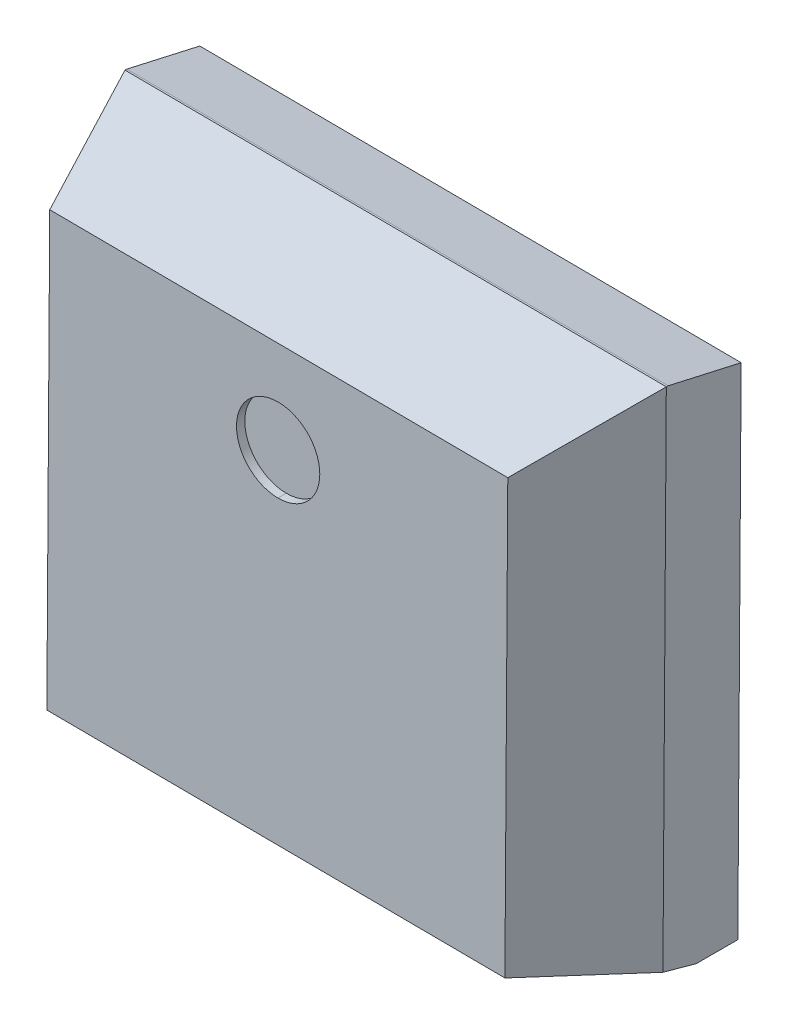
ISO-10303-21;
HEADER;
FILE_DESCRIPTION(('STEP AP214'),'2;1');
FILE_NAME('part.step','',(''),(''),'','','');
FILE_SCHEMA(('AUTOMOTIVE_DESIGN { 1 0 10303 214 1 1 1 1 }'));
ENDSEC;
DATA;
#1=APPLICATION_CONTEXT('core data for automotive mechanical design processes');
#2=APPLICATION_PROTOCOL_DEFINITION('international standard','automotive_design',2000,#1);
#3=PRODUCT_CONTEXT('',#1,'mechanical');
#4=PRODUCT('Part','Part','',(#3));
#5=PRODUCT_RELATED_PRODUCT_CATEGORY('part','',(#4));
#6=PRODUCT_DEFINITION_FORMATION('','',#4);
#7=PRODUCT_DEFINITION_CONTEXT('part definition',#1,'design');
#8=PRODUCT_DEFINITION('design','',#6,#7);
#9=PRODUCT_DEFINITION_SHAPE('','',#8);
#10=(LENGTH_UNIT() NAMED_UNIT(*) SI_UNIT(.MILLI.,.METRE.));
#11=(NAMED_UNIT(*) PLANE_ANGLE_UNIT() SI_UNIT($,.RADIAN.));
#12=(NAMED_UNIT(*) SI_UNIT($,.STERADIAN.) SOLID_ANGLE_UNIT());
#13=UNCERTAINTY_MEASURE_WITH_UNIT(LENGTH_MEASURE(1.E-05),#10,'distance_accuracy_value','');
#14=(GEOMETRIC_REPRESENTATION_CONTEXT(3) GLOBAL_UNCERTAINTY_ASSIGNED_CONTEXT((#13)) GLOBAL_UNIT_ASSIGNED_CONTEXT((#10,
#11,#12)) REPRESENTATION_CONTEXT('',''));
#15=CARTESIAN_POINT('',(0.,0.,0.));
#16=DIRECTION('',(0.,0.,1.));
#17=DIRECTION('',(1.,0.,0.));
#18=AXIS2_PLACEMENT_3D('',#15,#16,#17);
#19=CARTESIAN_POINT('',(202.089449758014,99.0514799525526,144.531582908599));
#20=DIRECTION('',(0.,0.,-1.));
#21=DIRECTION('',(0.00663069374923224,0.99997801670857,0.));
#22=AXIS2_PLACEMENT_3D('',#19,#20,#21);
#23=CYLINDRICAL_SURFACE('',#22,0.5);
#24=CARTESIAN_POINT('',(202.089449758014,99.0514799525526,144.531582908599));
#25=DIRECTION('',(0.,0.,-1.));
#26=DIRECTION('',(0.00663069374923224,0.99997801670857,0.));
#27=AXIS2_PLACEMENT_3D('',#24,#25,#26);
#28=CIRCLE('',#27,0.5);
#29=CARTESIAN_POINT('',(202.086134411139,98.5514909441983,144.531582908599));
#30=VERTEX_POINT('',#29);
#31=CARTESIAN_POINT('',(202.092765104888,99.5514689609069,144.531582908599));
#32=VERTEX_POINT('',#31);
#33=EDGE_CURVE('E67',#30,#32,#28,.T.);
#34=ORIENTED_EDGE('',*,*,#33,.F.);
#35=DIRECTION('',(0.,0.,-1.));
#36=VECTOR('',#35,1.);
#37=CARTESIAN_POINT('',(202.086134411139,98.5514909441983,144.531582908599));
#38=LINE('',#37,#36);
#39=CARTESIAN_POINT('',(202.086134411139,98.5514909441983,144.431582908599));
#40=VERTEX_POINT('',#39);
#41=EDGE_CURVE('E11',#30,#40,#38,.T.);
#42=ORIENTED_EDGE('',*,*,#41,.T.);
#43=CARTESIAN_POINT('',(202.089449758014,99.0514799525526,144.431582908599));
#44=DIRECTION('',(0.,0.,-1.));
#45=DIRECTION('',(0.00663069374923224,0.99997801670857,0.));
#46=AXIS2_PLACEMENT_3D('',#43,#44,#45);
#47=CIRCLE('',#46,0.5);
#48=CARTESIAN_POINT('',(202.092765104888,99.5514689609069,144.431582908599));
#49=VERTEX_POINT('',#48);
#50=EDGE_CURVE('E55',#40,#49,#47,.T.);
#51=ORIENTED_EDGE('',*,*,#50,.T.);
#52=DIRECTION('',(0.,0.,-1.));
#53=VECTOR('',#52,1.);
#54=CARTESIAN_POINT('',(202.092765104888,99.5514689609069,144.531582908599));
#55=LINE('',#54,#53);
#56=EDGE_CURVE('E128',#32,#49,#55,.T.);
#57=ORIENTED_EDGE('',*,*,#56,.F.);
#58=EDGE_LOOP('',(#34,#42,#51,#57));
#59=FACE_BOUND('',#58,.T.);
#60=ADVANCED_FACE('F44',(#59),#23,.F.);
#61=CARTESIAN_POINT('',(202.089449758014,99.0514799525526,144.431582908599));
#62=DIRECTION('',(0.,0.,-1.));
#63=DIRECTION('',(-1.,0.,0.));
#64=AXIS2_PLACEMENT_3D('',#61,#62,#63);
#65=PLANE('',#64);
#66=CARTESIAN_POINT('',(202.089449758014,99.0514799525526,144.431582908599));
#67=DIRECTION('',(0.,0.,-1.));
#68=DIRECTION('',(0.00663069374923224,0.99997801670857,0.));
#69=AXIS2_PLACEMENT_3D('',#66,#67,#68);
#70=CIRCLE('',#69,0.5);
#71=EDGE_CURVE('E132',#49,#40,#70,.T.);
#72=ORIENTED_EDGE('',*,*,#71,.F.);
#73=ORIENTED_EDGE('',*,*,#50,.F.);
#74=EDGE_LOOP('',(#72,#73));
#75=FACE_BOUND('',#74,.T.);
#76=ADVANCED_FACE('F140',(#75),#65,.F.);
#77=CARTESIAN_POINT('',(202.089449758014,99.0514799525526,144.531582908599));
#78=DIRECTION('',(0.,0.,-1.));
#79=DIRECTION('',(0.00663069374923224,0.99997801670857,0.));
#80=AXIS2_PLACEMENT_3D('',#77,#78,#79);
#81=CYLINDRICAL_SURFACE('',#80,0.5);
#82=ORIENTED_EDGE('',*,*,#41,.F.);
#83=CARTESIAN_POINT('',(202.089449758014,99.0514799525526,144.531582908599));
#84=DIRECTION('',(0.,0.,-1.));
#85=DIRECTION('',(0.00663069374923224,0.99997801670857,0.));
#86=AXIS2_PLACEMENT_3D('',#83,#84,#85);
#87=CIRCLE('',#86,0.5);
#88=EDGE_CURVE('E134',#32,#30,#87,.T.);
#89=ORIENTED_EDGE('',*,*,#88,.F.);
#90=ORIENTED_EDGE('',*,*,#56,.T.);
#91=ORIENTED_EDGE('',*,*,#71,.T.);
#92=EDGE_LOOP('',(#82,#89,#90,#91));
#93=FACE_BOUND('',#92,.T.);
#94=ADVANCED_FACE('F130',(#93),#81,.F.);
#95=CARTESIAN_POINT('',(199.09687577795,100.181347632347,143.831582908599));
#96=DIRECTION('',(0.94172120900801,-0.00624440220660673,-0.336336396997966));
#97=DIRECTION('',(0.,-0.999827697432078,0.0185627435383068));
#98=AXIS2_PLACEMENT_3D('',#95,#96,#97);
#99=PLANE('',#98);
#100=DIRECTION('',(-0.00663069374923689,-0.999978016708569,0.));
#101=VECTOR('',#100,1.);
#102=CARTESIAN_POINT('',(198.846881273772,100.183005305784,143.131582908599));
#103=LINE('',#102,#101);
#104=CARTESIAN_POINT('',(198.850196620647,100.682994314138,143.131582908599));
#105=VERTEX_POINT('',#104);
#106=CARTESIAN_POINT('',(198.809690449277,94.5742397187342,143.131582908599));
#107=VERTEX_POINT('',#106);
#108=EDGE_CURVE('E142',#105,#107,#103,.T.);
#109=ORIENTED_EDGE('',*,*,#108,.T.);
#110=DIRECTION('',(-0.327058115701999,-0.250915811518072,-0.911084103957305));
#111=VECTOR('',#110,1.);
#112=CARTESIAN_POINT('',(199.239655618504,94.9041048227679,144.329334660141));
#113=LINE('',#112,#111);
#114=CARTESIAN_POINT('',(199.312258060756,94.9598047116908,144.531582908599));
#115=VERTEX_POINT('',#114);
#116=EDGE_CURVE('E181',#115,#107,#113,.T.);
#117=ORIENTED_EDGE('',*,*,#116,.F.);
#118=DIRECTION('',(-0.00663069374923689,-0.999978016708569,0.));
#119=VECTOR('',#118,1.);
#120=CARTESIAN_POINT('',(199.346870282127,100.179689958909,144.531582908599));
#121=LINE('',#120,#119);
#122=CARTESIAN_POINT('',(199.346870282127,100.179689958909,144.531582908599));
#123=VERTEX_POINT('',#122);
#124=EDGE_CURVE('E159',#123,#115,#121,.T.);
#125=ORIENTED_EDGE('',*,*,#124,.F.);
#126=DIRECTION('',(-0.316667560551509,0.320895136477479,-0.892607398288552));
#127=VECTOR('',#126,1.);
#128=CARTESIAN_POINT('',(199.426620727771,100.098874828699,144.756379656566));
#129=LINE('',#128,#127);
#130=EDGE_CURVE('E148',#123,#105,#129,.T.);
#131=ORIENTED_EDGE('',*,*,#130,.T.);
#132=EDGE_LOOP('',(#109,#117,#125,#131));
#133=FACE_BOUND('',#132,.T.);
#134=ADVANCED_FACE('F259',(#133),#99,.F.);
#135=CARTESIAN_POINT('',(202.07950371739,97.5515129274897,144.531582908599));
#136=DIRECTION('',(0.,0.,1.));
#137=DIRECTION('',(1.,0.,0.));
#138=AXIS2_PLACEMENT_3D('',#135,#136,#137);
#139=PLANE('',#138);
#140=DIRECTION('',(-0.999978016708569,0.00663069374923689,0.));
#141=VECTOR('',#140,1.);
#142=CARTESIAN_POINT('',(205.346738382378,100.139905796414,144.531582908599));
#143=LINE('',#142,#141);
#144=CARTESIAN_POINT('',(204.846749374023,100.143221143289,144.531582908599));
#145=VERTEX_POINT('',#144);
#146=EDGE_CURVE('E163',#145,#123,#143,.T.);
#147=ORIENTED_EDGE('',*,*,#146,.T.);
#148=ORIENTED_EDGE('',*,*,#124,.T.);
#149=DIRECTION('',(0.999978016708569,-0.00663069374923689,0.));
#150=VECTOR('',#149,1.);
#151=CARTESIAN_POINT('',(198.812269052401,94.9631200585654,144.531582908599));
#152=LINE('',#151,#150);
#153=CARTESIAN_POINT('',(204.812137152652,94.92333589607,144.531582908599));
#154=VERTEX_POINT('',#153);
#155=EDGE_CURVE('E164',#115,#154,#152,.T.);
#156=ORIENTED_EDGE('',*,*,#155,.T.);
#157=DIRECTION('',(0.00663069374923689,0.999978016708569,0.));
#158=VECTOR('',#157,1.);
#159=CARTESIAN_POINT('',(204.812137152652,94.92333589607,144.531582908599));
#160=LINE('',#159,#158);
#161=EDGE_CURVE('E168',#154,#145,#160,.T.);
#162=ORIENTED_EDGE('',*,*,#161,.T.);
#163=EDGE_LOOP('',(#147,#148,#156,#162));
#164=FACE_BOUND('',#163,.T.);
#165=ORIENTED_EDGE('',*,*,#88,.T.);
#166=ORIENTED_EDGE('',*,*,#33,.T.);
#167=EDGE_LOOP('',(#165,#166));
#168=FACE_BOUND('',#167,.T.);
#169=ADVANCED_FACE('F297',(#164,#168),#139,.T.);
#170=CARTESIAN_POINT('',(198.808953705527,94.4631310502111,142.231582908599));
#171=DIRECTION('',(0.00663069374923689,0.99997801670857,0.));
#172=DIRECTION('',(0.,0.,-1.));
#173=AXIS2_PLACEMENT_3D('',#170,#171,#172);
#174=PLANE('',#173);
#175=DIRECTION('',(0.999978016708569,-0.00663069374923689,0.));
#176=VECTOR('',#175,1.);
#177=CARTESIAN_POINT('',(198.808953705527,94.4631310502111,142.231582908599));
#178=LINE('',#177,#176);
#179=CARTESIAN_POINT('',(198.808953705527,94.4631310502111,142.231582908599));
#180=VERTEX_POINT('',#179);
#181=CARTESIAN_POINT('',(205.308810814132,94.420031540841,142.231582908599));
#182=VERTEX_POINT('',#181);
#183=EDGE_CURVE('E173',#180,#182,#178,.T.);
#184=ORIENTED_EDGE('',*,*,#183,.T.);
#185=DIRECTION('',(0.,0.,1.));
#186=VECTOR('',#185,1.);
#187=CARTESIAN_POINT('',(205.308810814132,94.420031540841,142.231582908599));
#188=LINE('',#187,#186);
#189=CARTESIAN_POINT('',(205.308810814132,94.420031540841,142.731582908599));
#190=VERTEX_POINT('',#189);
#191=EDGE_CURVE('E177',#182,#190,#188,.T.);
#192=ORIENTED_EDGE('',*,*,#191,.T.);
#193=DIRECTION('',(0.999978016708569,-0.00663069374923689,0.));
#194=VECTOR('',#193,1.);
#195=CARTESIAN_POINT('',(198.808953705527,94.4631310502111,142.731582908599));
#196=LINE('',#195,#194);
#197=CARTESIAN_POINT('',(198.808953705527,94.4631310502111,142.731582908599));
#198=VERTEX_POINT('',#197);
#199=EDGE_CURVE('E223',#198,#190,#196,.T.);
#200=ORIENTED_EDGE('',*,*,#199,.F.);
#201=DIRECTION('',(0.,0.,1.));
#202=VECTOR('',#201,1.);
#203=CARTESIAN_POINT('',(198.808953705527,94.4631310502111,142.231582908599));
#204=LINE('',#203,#202);
#205=EDGE_CURVE('E187',#180,#198,#204,.T.);
#206=ORIENTED_EDGE('',*,*,#205,.F.);
#207=EDGE_LOOP('',(#184,#192,#200,#206));
#208=FACE_BOUND('',#207,.T.);
#209=ADVANCED_FACE('F293',(#208),#174,.F.);
#210=CARTESIAN_POINT('',(198.810611378964,94.7131255543882,143.631582908599));
#211=DIRECTION('',(0.00638879218066123,0.963496728334963,-0.267643863785991));
#212=DIRECTION('',(-0.999715221369126,0.,-0.0238636996896671));
#213=AXIS2_PLACEMENT_3D('',#210,#211,#212);
#214=PLANE('',#213);
#215=ORIENTED_EDGE('',*,*,#155,.F.);
#216=ORIENTED_EDGE('',*,*,#116,.T.);
#217=DIRECTION('',(0.00177466449462739,0.267637980092934,0.963517909629969));
#218=VECTOR('',#217,1.);
#219=CARTESIAN_POINT('',(198.810832243763,94.7464342777238,143.751496948714));
#220=LINE('',#219,#218);
#221=EDGE_CURVE('E191',#198,#107,#220,.T.);
#222=ORIENTED_EDGE('',*,*,#221,.F.);
#223=ORIENTED_EDGE('',*,*,#199,.T.);
#224=DIRECTION('',(0.00177466449462739,0.267637980092934,0.963517909629969));
#225=VECTOR('',#224,1.);
#226=CARTESIAN_POINT('',(205.309212170595,94.4805602961505,142.949491218055));
#227=LINE('',#226,#225);
#228=CARTESIAN_POINT('',(205.309547557882,94.5311402093641,143.131582908599));
#229=VERTEX_POINT('',#228);
#230=EDGE_CURVE('E48',#190,#229,#227,.T.);
#231=ORIENTED_EDGE('',*,*,#230,.T.);
#232=DIRECTION('',(0.323701938105808,-0.25523089699889,-0.911084103957305));
#233=VECTOR('',#232,1.);
#234=CARTESIAN_POINT('',(204.755493847069,94.9679977284263,144.691009866667));
#235=LINE('',#234,#233);
#236=EDGE_CURVE('E157',#154,#229,#235,.T.);
#237=ORIENTED_EDGE('',*,*,#236,.F.);
#238=EDGE_LOOP('',(#215,#216,#222,#223,#231,#237));
#239=FACE_BOUND('',#238,.T.);
#240=ADVANCED_FACE('F269',(#239),#214,.F.);
#241=CARTESIAN_POINT('',(202.07950371739,97.5515129274897,142.231582908599));
#242=DIRECTION('',(0.,0.,1.));
#243=DIRECTION('',(1.,0.,0.));
#244=AXIS2_PLACEMENT_3D('',#241,#242,#243);
#245=PLANE('',#244);
#246=DIRECTION('',(-0.999978016708569,0.00663069374923689,0.));
#247=VECTOR('',#246,1.);
#248=CARTESIAN_POINT('',(205.348727590503,100.439899201427,142.231582908599));
#249=LINE('',#248,#247);
#250=CARTESIAN_POINT('',(205.348727590503,100.439899201427,142.231582908599));
#251=VERTEX_POINT('',#250);
#252=CARTESIAN_POINT('',(198.848870481897,100.482998710797,142.231582908599));
#253=VERTEX_POINT('',#252);
#254=EDGE_CURVE('E197',#251,#253,#249,.T.);
#255=ORIENTED_EDGE('',*,*,#254,.F.);
#256=DIRECTION('',(0.00663069374923689,0.999978016708569,0.));
#257=VECTOR('',#256,1.);
#258=CARTESIAN_POINT('',(205.308810814132,94.420031540841,142.231582908599));
#259=LINE('',#258,#257);
#260=EDGE_CURVE('E182',#182,#251,#259,.T.);
#261=ORIENTED_EDGE('',*,*,#260,.F.);
#262=ORIENTED_EDGE('',*,*,#183,.F.);
#263=DIRECTION('',(-0.00663069374923689,-0.999978016708569,0.));
#264=VECTOR('',#263,1.);
#265=CARTESIAN_POINT('',(198.850196620647,100.682994314138,142.231582908599));
#266=LINE('',#265,#264);
#267=EDGE_CURVE('E151',#253,#180,#266,.T.);
#268=ORIENTED_EDGE('',*,*,#267,.F.);
#269=EDGE_LOOP('',(#255,#261,#262,#268));
#270=FACE_BOUND('',#269,.T.);
#271=ADVANCED_FACE('F318',(#270),#245,.F.);
#272=CARTESIAN_POINT('',(205.06213165683,94.9216782226327,143.831582908599));
#273=DIRECTION('',(-0.94172120900801,0.00624440220660673,-0.336336396997966));
#274=DIRECTION('',(-0.336342954498126,0.,0.94173956960482));
#275=AXIS2_PLACEMENT_3D('',#272,#273,#274);
#276=PLANE('',#275);
#277=DIRECTION('',(0.00663069374923689,0.999978016708569,0.));
#278=VECTOR('',#277,1.);
#279=CARTESIAN_POINT('',(205.312126161007,94.9200205491954,143.131582908599));
#280=LINE('',#279,#278);
#281=CARTESIAN_POINT('',(205.350053729252,100.639894804768,143.131582908599));
#282=VERTEX_POINT('',#281);
#283=EDGE_CURVE('E205',#229,#282,#280,.T.);
#284=ORIENTED_EDGE('',*,*,#283,.T.);
#285=DIRECTION('',(0.320895136477479,0.316667560551509,-0.892607398288552));
#286=VECTOR('',#285,1.);
#287=CARTESIAN_POINT('',(204.831404729047,100.128078653609,144.574265835428));
#288=LINE('',#287,#286);
#289=EDGE_CURVE('E196',#145,#282,#288,.T.);
#290=ORIENTED_EDGE('',*,*,#289,.F.);
#291=ORIENTED_EDGE('',*,*,#161,.F.);
#292=ORIENTED_EDGE('',*,*,#236,.T.);
#293=EDGE_LOOP('',(#284,#290,#291,#292));
#294=FACE_BOUND('',#293,.T.);
#295=ADVANCED_FACE('F239',(#294),#276,.F.);
#296=CARTESIAN_POINT('',(198.850196620647,100.682994314138,142.231582908599));
#297=DIRECTION('',(0.99997801670857,-0.00663069374923689,0.));
#298=DIRECTION('',(0.,0.,-1.));
#299=AXIS2_PLACEMENT_3D('',#296,#297,#298);
#300=PLANE('',#299);
#301=DIRECTION('',(-0.00146950166626721,-0.221616231627791,-0.97513285579143));
#302=VECTOR('',#301,1.);
#303=CARTESIAN_POINT('',(198.849234583842,100.537909095015,142.473193910564));
#304=LINE('',#303,#302);
#305=CARTESIAN_POINT('',(198.850196620647,100.682994314138,143.111582908599));
#306=VERTEX_POINT('',#305);
#307=EDGE_CURVE('E154',#306,#253,#304,.T.);
#308=ORIENTED_EDGE('',*,*,#307,.T.);
#309=ORIENTED_EDGE('',*,*,#267,.T.);
#310=ORIENTED_EDGE('',*,*,#205,.T.);
#311=ORIENTED_EDGE('',*,*,#221,.T.);
#312=ORIENTED_EDGE('',*,*,#108,.F.);
#313=DIRECTION('',(0.,0.,1.));
#314=VECTOR('',#313,1.);
#315=CARTESIAN_POINT('',(198.850196620647,100.682994314138,142.231582908599));
#316=LINE('',#315,#314);
#317=EDGE_CURVE('E211',#306,#105,#316,.T.);
#318=ORIENTED_EDGE('',*,*,#317,.F.);
#319=EDGE_LOOP('',(#308,#309,#310,#311,#312,#318));
#320=FACE_BOUND('',#319,.T.);
#321=ADVANCED_FACE('F46',(#320),#300,.F.);
#322=CARTESIAN_POINT('',(205.348396055815,100.389900300591,143.831582908599));
#323=DIRECTION('',(-0.00624440220660673,-0.94172120900801,-0.336336396997966));
#324=DIRECTION('',(0.,0.336342954498126,-0.94173956960482));
#325=AXIS2_PLACEMENT_3D('',#322,#323,#324);
#326=PLANE('',#325);
#327=ORIENTED_EDGE('',*,*,#289,.T.);
#328=DIRECTION('',(-0.999978016708569,0.00663069374923689,0.));
#329=VECTOR('',#328,1.);
#330=CARTESIAN_POINT('',(205.350053729252,100.639894804768,143.131582908599));
#331=LINE('',#330,#329);
#332=EDGE_CURVE('E192',#282,#105,#331,.T.);
#333=ORIENTED_EDGE('',*,*,#332,.T.);
#334=ORIENTED_EDGE('',*,*,#130,.F.);
#335=ORIENTED_EDGE('',*,*,#146,.F.);
#336=EDGE_LOOP('',(#327,#333,#334,#335));
#337=FACE_BOUND('',#336,.T.);
#338=ADVANCED_FACE('F235',(#337),#326,.F.);
#339=CARTESIAN_POINT('',(205.349390659877,100.539897003097,142.671582908599));
#340=DIRECTION('',(0.00646580733157176,0.975111419161678,-0.221621103589098));
#341=DIRECTION('',(-0.999574679655963,0.,-0.0291626437532592));
#342=AXIS2_PLACEMENT_3D('',#339,#340,#341);
#343=PLANE('',#342);
#344=ORIENTED_EDGE('',*,*,#254,.T.);
#345=ORIENTED_EDGE('',*,*,#307,.F.);
#346=DIRECTION('',(-0.999978016708569,0.00663069374923689,0.));
#347=VECTOR('',#346,1.);
#348=CARTESIAN_POINT('',(205.350053729252,100.639894804768,143.111582908599));
#349=LINE('',#348,#347);
#350=CARTESIAN_POINT('',(205.350053729252,100.639894804768,143.111582908599));
#351=VERTEX_POINT('',#350);
#352=EDGE_CURVE('E204',#351,#306,#349,.T.);
#353=ORIENTED_EDGE('',*,*,#352,.F.);
#354=DIRECTION('',(-0.00146950166626721,-0.221616231627791,-0.97513285579143));
#355=VECTOR('',#354,1.);
#356=CARTESIAN_POINT('',(205.348078850722,100.342062452444,141.801091749463));
#357=LINE('',#356,#355);
#358=EDGE_CURVE('E185',#351,#251,#357,.T.);
#359=ORIENTED_EDGE('',*,*,#358,.T.);
#360=EDGE_LOOP('',(#344,#345,#353,#359));
#361=FACE_BOUND('',#360,.T.);
#362=ADVANCED_FACE('F329',(#361),#343,.T.);
#363=CARTESIAN_POINT('',(205.308810814132,94.420031540841,142.231582908599));
#364=DIRECTION('',(-0.99997801670857,0.00663069374923689,0.));
#365=DIRECTION('',(0.,0.,1.));
#366=AXIS2_PLACEMENT_3D('',#363,#364,#365);
#367=PLANE('',#366);
#368=ORIENTED_EDGE('',*,*,#283,.F.);
#369=ORIENTED_EDGE('',*,*,#230,.F.);
#370=ORIENTED_EDGE('',*,*,#191,.F.);
#371=ORIENTED_EDGE('',*,*,#260,.T.);
#372=ORIENTED_EDGE('',*,*,#358,.F.);
#373=DIRECTION('',(0.,0.,1.));
#374=VECTOR('',#373,1.);
#375=CARTESIAN_POINT('',(205.350053729252,100.639894804768,142.231582908599));
#376=LINE('',#375,#374);
#377=EDGE_CURVE('E186',#351,#282,#376,.T.);
#378=ORIENTED_EDGE('',*,*,#377,.T.);
#379=EDGE_LOOP('',(#368,#369,#370,#371,#372,#378));
#380=FACE_BOUND('',#379,.T.);
#381=ADVANCED_FACE('F246',(#380),#367,.F.);
#382=CARTESIAN_POINT('',(205.350053729252,100.639894804768,142.231582908599));
#383=DIRECTION('',(-0.00663069374923689,-0.99997801670857,0.));
#384=DIRECTION('',(-0.99997801670857,0.00663069374923689,0.));
#385=AXIS2_PLACEMENT_3D('',#382,#383,#384);
#386=PLANE('',#385);
#387=ORIENTED_EDGE('',*,*,#352,.T.);
#388=ORIENTED_EDGE('',*,*,#317,.T.);
#389=ORIENTED_EDGE('',*,*,#332,.F.);
#390=ORIENTED_EDGE('',*,*,#377,.F.);
#391=EDGE_LOOP('',(#387,#388,#389,#390));
#392=FACE_BOUND('',#391,.T.);
#393=ADVANCED_FACE('F248',(#392),#386,.F.);
#394=CLOSED_SHELL('',(#60,#76,#94,#134,#169,#209,#240,#271,#295,#321,#338,#362,#381,#393));
#395=MANIFOLD_SOLID_BREP('B2',#394);
#396=ADVANCED_BREP_SHAPE_REPRESENTATION('',(#18,#395),#14);
#397=SHAPE_DEFINITION_REPRESENTATION(#9,#396);
ENDSEC;
END-ISO-10303-21;
